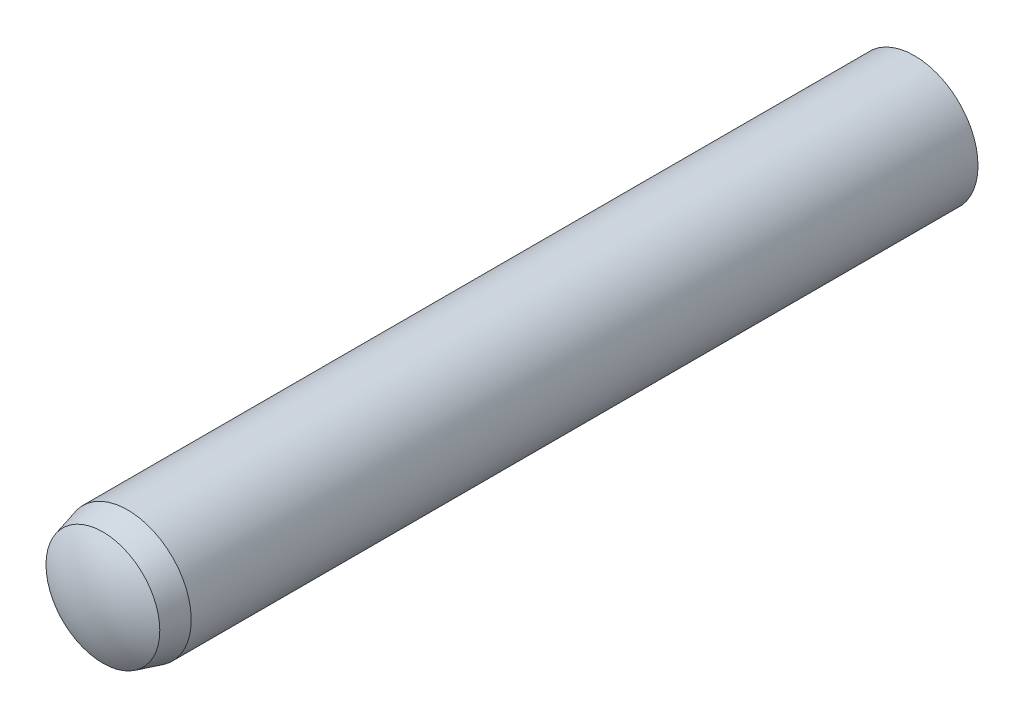
ISO-10303-21;
HEADER;
FILE_DESCRIPTION(('STEP AP214'),'2;1');
FILE_NAME('part.step','',(''),(''),'','','');
FILE_SCHEMA(('AUTOMOTIVE_DESIGN { 1 0 10303 214 1 1 1 1 }'));
ENDSEC;
DATA;
#1=APPLICATION_CONTEXT('core data for automotive mechanical design processes');
#2=APPLICATION_PROTOCOL_DEFINITION('international standard','automotive_design',2000,#1);
#3=PRODUCT_CONTEXT('',#1,'mechanical');
#4=PRODUCT('Part','Part','',(#3));
#5=PRODUCT_RELATED_PRODUCT_CATEGORY('part','',(#4));
#6=PRODUCT_DEFINITION_FORMATION('','',#4);
#7=PRODUCT_DEFINITION_CONTEXT('part definition',#1,'design');
#8=PRODUCT_DEFINITION('design','',#6,#7);
#9=PRODUCT_DEFINITION_SHAPE('','',#8);
#10=(LENGTH_UNIT() NAMED_UNIT(*) SI_UNIT(.MILLI.,.METRE.));
#11=(NAMED_UNIT(*) PLANE_ANGLE_UNIT() SI_UNIT($,.RADIAN.));
#12=(NAMED_UNIT(*) SI_UNIT($,.STERADIAN.) SOLID_ANGLE_UNIT());
#13=UNCERTAINTY_MEASURE_WITH_UNIT(LENGTH_MEASURE(1.E-05),#10,'distance_accuracy_value','');
#14=(GEOMETRIC_REPRESENTATION_CONTEXT(3) GLOBAL_UNCERTAINTY_ASSIGNED_CONTEXT((#13)) GLOBAL_UNIT_ASSIGNED_CONTEXT((#10,
#11,#12)) REPRESENTATION_CONTEXT('',''));
#15=CARTESIAN_POINT('',(0.,0.,0.));
#16=DIRECTION('',(0.,0.,1.));
#17=DIRECTION('',(1.,0.,0.));
#18=AXIS2_PLACEMENT_3D('',#15,#16,#17);
#19=CARTESIAN_POINT('',(0.,0.,-7.27499999999998));
#20=DIRECTION('',(0.,0.,1.));
#21=DIRECTION('',(0.,1.,0.));
#22=AXIS2_PLACEMENT_3D('',#19,#20,#21);
#23=SPHERICAL_SURFACE('',#22,2.72500000000002);
#24=CARTESIAN_POINT('',(0.,0.,-9.55));
#25=DIRECTION('',(0.,0.,1.));
#26=DIRECTION('',(0.,-1.,0.));
#27=AXIS2_PLACEMENT_3D('',#24,#25,#26);
#28=CIRCLE('',#27,1.5);
#29=CARTESIAN_POINT('',(0.,-1.49999999999999,-9.55));
#30=VERTEX_POINT('',#29);
#31=EDGE_CURVE('E10',#30,#30,#28,.T.);
#32=ORIENTED_EDGE('',*,*,#31,.F.);
#33=EDGE_LOOP('',(#32));
#34=FACE_BOUND('',#33,.T.);
#35=ADVANCED_FACE('F30',(#34),#23,.T.);
#36=CARTESIAN_POINT('',(0.,0.,10.));
#37=DIRECTION('',(0.,0.,1.));
#38=DIRECTION('',(0.,-1.,0.));
#39=AXIS2_PLACEMENT_3D('',#36,#37,#38);
#40=CYLINDRICAL_SURFACE('',#39,1.5);
#41=CARTESIAN_POINT('',(0.,0.,9.025));
#42=DIRECTION('',(0.,0.,1.));
#43=DIRECTION('',(0.,-1.,0.));
#44=AXIS2_PLACEMENT_3D('',#41,#42,#43);
#45=CIRCLE('',#44,1.5);
#46=CARTESIAN_POINT('',(0.,-1.5,9.025));
#47=VERTEX_POINT('',#46);
#48=EDGE_CURVE('E36',#47,#47,#45,.T.);
#49=ORIENTED_EDGE('',*,*,#48,.F.);
#50=EDGE_LOOP('',(#49));
#51=FACE_BOUND('',#50,.T.);
#52=ORIENTED_EDGE('',*,*,#31,.T.);
#53=EDGE_LOOP('',(#52));
#54=FACE_BOUND('',#53,.T.);
#55=ADVANCED_FACE('F51',(#51,#54),#40,.T.);
#56=CARTESIAN_POINT('',(0.,0.,9.025));
#57=DIRECTION('',(0.,0.,-1.));
#58=DIRECTION('',(0.,1.,0.));
#59=AXIS2_PLACEMENT_3D('',#56,#57,#58);
#60=CONICAL_SURFACE('',#59,1.5,0.261799387799152);
#61=CARTESIAN_POINT('',(0.,0.,9.61));
#62=DIRECTION('',(0.,0.,1.));
#63=DIRECTION('',(0.,-1.,0.));
#64=AXIS2_PLACEMENT_3D('',#61,#62,#63);
#65=CIRCLE('',#64,1.34324972242779);
#66=CARTESIAN_POINT('',(0.,-1.34324972242779,9.61));
#67=VERTEX_POINT('',#66);
#68=EDGE_CURVE('E40',#67,#67,#65,.T.);
#69=ORIENTED_EDGE('',*,*,#68,.F.);
#70=EDGE_LOOP('',(#69));
#71=FACE_BOUND('',#70,.T.);
#72=ORIENTED_EDGE('',*,*,#48,.T.);
#73=EDGE_LOOP('',(#72));
#74=FACE_BOUND('',#73,.T.);
#75=ADVANCED_FACE('F49',(#71,#74),#60,.T.);
#76=CARTESIAN_POINT('',(0.,0.,7.49176946563802));
#77=DIRECTION('',(0.,0.,1.));
#78=DIRECTION('',(0.,1.,0.));
#79=AXIS2_PLACEMENT_3D('',#76,#77,#78);
#80=SPHERICAL_SURFACE('',#79,2.50823053436198);
#81=ORIENTED_EDGE('',*,*,#68,.T.);
#82=EDGE_LOOP('',(#81));
#83=FACE_BOUND('',#82,.T.);
#84=ADVANCED_FACE('F47',(#83),#80,.T.);
#85=CLOSED_SHELL('',(#35,#55,#75,#84));
#86=MANIFOLD_SOLID_BREP('B2',#85);
#87=ADVANCED_BREP_SHAPE_REPRESENTATION('',(#18,#86),#14);
#88=SHAPE_DEFINITION_REPRESENTATION(#9,#87);
ENDSEC;
END-ISO-10303-21;
